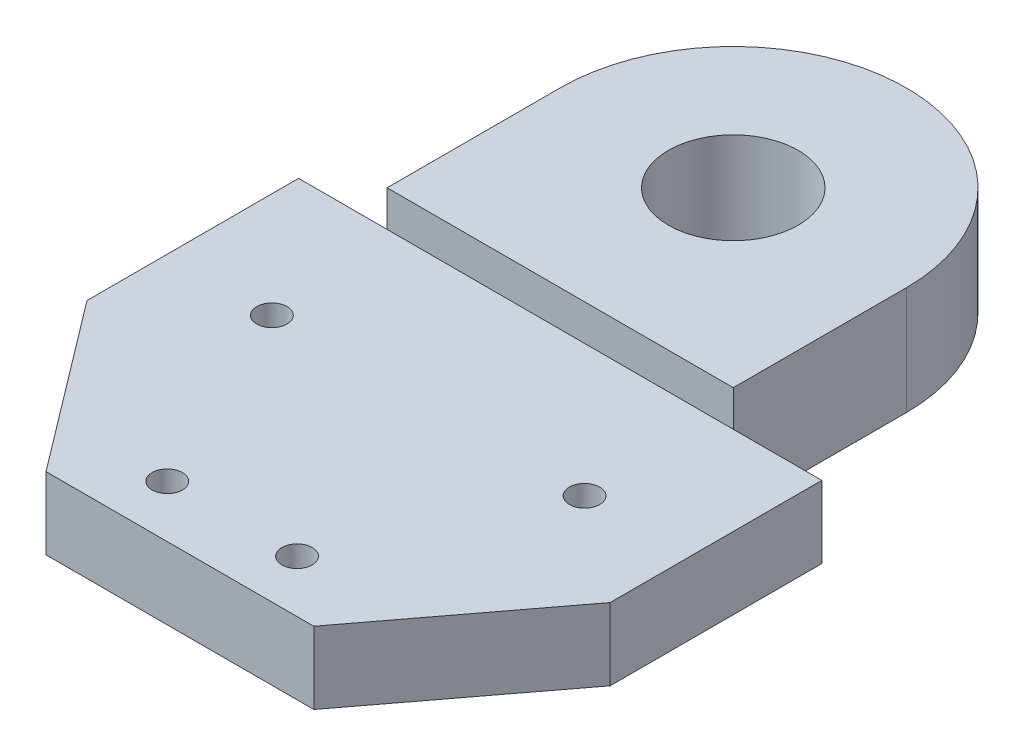
ISO-10303-21;
HEADER;
FILE_DESCRIPTION(('STEP AP214'),'2;1');
FILE_NAME('part.step','',(''),(''),'','','');
FILE_SCHEMA(('AUTOMOTIVE_DESIGN { 1 0 10303 214 1 1 1 1 }'));
ENDSEC;
DATA;
#1=APPLICATION_CONTEXT('core data for automotive mechanical design processes');
#2=APPLICATION_PROTOCOL_DEFINITION('international standard','automotive_design',2000,#1);
#3=PRODUCT_CONTEXT('',#1,'mechanical');
#4=PRODUCT('Part','Part','',(#3));
#5=PRODUCT_RELATED_PRODUCT_CATEGORY('part','',(#4));
#6=PRODUCT_DEFINITION_FORMATION('','',#4);
#7=PRODUCT_DEFINITION_CONTEXT('part definition',#1,'design');
#8=PRODUCT_DEFINITION('design','',#6,#7);
#9=PRODUCT_DEFINITION_SHAPE('','',#8);
#10=(LENGTH_UNIT() NAMED_UNIT(*) SI_UNIT(.MILLI.,.METRE.));
#11=(NAMED_UNIT(*) PLANE_ANGLE_UNIT() SI_UNIT($,.RADIAN.));
#12=(NAMED_UNIT(*) SI_UNIT($,.STERADIAN.) SOLID_ANGLE_UNIT());
#13=UNCERTAINTY_MEASURE_WITH_UNIT(LENGTH_MEASURE(1.E-05),#10,'distance_accuracy_value','');
#14=(GEOMETRIC_REPRESENTATION_CONTEXT(3) GLOBAL_UNCERTAINTY_ASSIGNED_CONTEXT((#13)) GLOBAL_UNIT_ASSIGNED_CONTEXT((#10,
#11,#12)) REPRESENTATION_CONTEXT('',''));
#15=CARTESIAN_POINT('',(0.,0.,0.));
#16=DIRECTION('',(0.,0.,1.));
#17=DIRECTION('',(1.,0.,0.));
#18=AXIS2_PLACEMENT_3D('',#15,#16,#17);
#19=CARTESIAN_POINT('',(-30.2250218467829,8.33333333333333,-37.9076946759163));
#20=DIRECTION('',(0.,0.,1.));
#21=DIRECTION('',(1.,0.,0.));
#22=AXIS2_PLACEMENT_3D('',#19,#20,#21);
#23=PLANE('',#22);
#24=DIRECTION('',(0.,-1.,0.));
#25=VECTOR('',#24,1.);
#26=CARTESIAN_POINT('',(20.,12.5,-37.9076946759163));
#27=LINE('',#26,#25);
#28=CARTESIAN_POINT('',(20.,8.33333333333333,-37.9076946759163));
#29=VERTEX_POINT('',#28);
#30=CARTESIAN_POINT('',(20.,0.,-37.9076946759163));
#31=VERTEX_POINT('',#30);
#32=EDGE_CURVE('E11',#29,#31,#27,.T.);
#33=ORIENTED_EDGE('',*,*,#32,.F.);
#34=DIRECTION('',(-1.,0.,0.));
#35=VECTOR('',#34,1.);
#36=CARTESIAN_POINT('',(30.225021846783,8.33333333333333,-37.9076946759163));
#37=LINE('',#36,#35);
#38=CARTESIAN_POINT('',(30.225021846783,8.33333333333333,-37.9076946759163));
#39=VERTEX_POINT('',#38);
#40=EDGE_CURVE('E147',#39,#29,#37,.T.);
#41=ORIENTED_EDGE('',*,*,#40,.F.);
#42=DIRECTION('',(0.,-1.,0.));
#43=VECTOR('',#42,1.);
#44=CARTESIAN_POINT('',(30.225021846783,8.33333333333333,-37.9076946759163));
#45=LINE('',#44,#43);
#46=CARTESIAN_POINT('',(30.225021846783,0.,-37.9076946759163));
#47=VERTEX_POINT('',#46);
#48=EDGE_CURVE('E137',#39,#47,#45,.T.);
#49=ORIENTED_EDGE('',*,*,#48,.T.);
#50=DIRECTION('',(-1.,0.,0.));
#51=VECTOR('',#50,1.);
#52=CARTESIAN_POINT('',(-30.2250218467829,0.,-37.9076946759163));
#53=LINE('',#52,#51);
#54=EDGE_CURVE('E168',#47,#31,#53,.T.);
#55=ORIENTED_EDGE('',*,*,#54,.T.);
#56=EDGE_LOOP('',(#33,#41,#49,#55));
#57=FACE_BOUND('',#56,.T.);
#58=ADVANCED_FACE('F39',(#57),#23,.F.);
#59=CARTESIAN_POINT('',(0.,8.33333333333333,0.));
#60=DIRECTION('',(0.,-1.,0.));
#61=DIRECTION('',(0.,0.,-1.));
#62=AXIS2_PLACEMENT_3D('',#59,#60,#61);
#63=PLANE('',#62);
#64=DIRECTION('',(0.,0.,1.));
#65=VECTOR('',#64,1.);
#66=CARTESIAN_POINT('',(-30.2250218467829,8.33333333333333,-13.4540284696905));
#67=LINE('',#66,#65);
#68=CARTESIAN_POINT('',(-30.2250218467829,8.33333333333333,-37.9076946759163));
#69=VERTEX_POINT('',#68);
#70=CARTESIAN_POINT('',(-30.2250218467829,8.33333333333333,-13.4540284696905));
#71=VERTEX_POINT('',#70);
#72=EDGE_CURVE('E172',#69,#71,#67,.T.);
#73=ORIENTED_EDGE('',*,*,#72,.T.);
#74=DIRECTION('',(0.603519095490218,0.,0.797348544476422));
#75=VECTOR('',#74,1.);
#76=CARTESIAN_POINT('',(-30.2250218467829,8.33333333333333,-13.4540284696905));
#77=LINE('',#76,#75);
#78=CARTESIAN_POINT('',(-15.4734854447642,8.33333333333333,6.03519095490218));
#79=VERTEX_POINT('',#78);
#80=EDGE_CURVE('E103',#71,#79,#77,.T.);
#81=ORIENTED_EDGE('',*,*,#80,.T.);
#82=DIRECTION('',(1.,0.,0.));
#83=VECTOR('',#82,1.);
#84=CARTESIAN_POINT('',(-15.4734854447642,8.33333333333333,6.03519095490218));
#85=LINE('',#84,#83);
#86=CARTESIAN_POINT('',(15.4734854447642,8.33333333333333,6.03519095490223));
#87=VERTEX_POINT('',#86);
#88=EDGE_CURVE('E121',#79,#87,#85,.T.);
#89=ORIENTED_EDGE('',*,*,#88,.T.);
#90=DIRECTION('',(0.603519095490223,0.,-0.797348544476418));
#91=VECTOR('',#90,1.);
#92=CARTESIAN_POINT('',(30.225021846783,8.33333333333333,-13.4540284696903));
#93=LINE('',#92,#91);
#94=CARTESIAN_POINT('',(30.225021846783,8.33333333333333,-13.4540284696903));
#95=VERTEX_POINT('',#94);
#96=EDGE_CURVE('E112',#87,#95,#93,.T.);
#97=ORIENTED_EDGE('',*,*,#96,.T.);
#98=DIRECTION('',(0.,0.,-1.));
#99=VECTOR('',#98,1.);
#100=CARTESIAN_POINT('',(30.225021846783,8.33333333333333,-13.4540284696903));
#101=LINE('',#100,#99);
#102=EDGE_CURVE('E118',#95,#39,#101,.T.);
#103=ORIENTED_EDGE('',*,*,#102,.T.);
#104=ORIENTED_EDGE('',*,*,#40,.T.);
#105=CARTESIAN_POINT('',(-20.,8.33333333333333,-37.9076946759163));
#106=VERTEX_POINT('',#105);
#107=EDGE_CURVE('E145',#29,#106,#37,.T.);
#108=ORIENTED_EDGE('',*,*,#107,.T.);
#109=EDGE_CURVE('E67',#106,#69,#37,.T.);
#110=ORIENTED_EDGE('',*,*,#109,.T.);
#111=EDGE_LOOP('',(#73,#81,#89,#97,#103,#104,#108,#110));
#112=FACE_BOUND('',#111,.T.);
#113=CARTESIAN_POINT('',(-18.0654565435174,8.33333333333333,-22.6576946759163));
#114=DIRECTION('',(0.,1.,0.));
#115=DIRECTION('',(0.,0.,1.));
#116=AXIS2_PLACEMENT_3D('',#113,#114,#115);
#117=CIRCLE('',#116,1.75);
#118=CARTESIAN_POINT('',(-18.0654565435174,8.33333333333333,-20.9076946759163));
#119=VERTEX_POINT('',#118);
#120=EDGE_CURVE('E157',#119,#119,#117,.T.);
#121=ORIENTED_EDGE('',*,*,#120,.F.);
#122=EDGE_LOOP('',(#121));
#123=FACE_BOUND('',#122,.T.);
#124=CARTESIAN_POINT('',(18.0654565435176,8.33333333333333,-22.6576946759162));
#125=DIRECTION('',(0.,1.,0.));
#126=DIRECTION('',(0.,0.,1.));
#127=AXIS2_PLACEMENT_3D('',#124,#125,#126);
#128=CIRCLE('',#127,1.75);
#129=CARTESIAN_POINT('',(18.0654565435176,8.33333333333333,-20.9076946759162));
#130=VERTEX_POINT('',#129);
#131=EDGE_CURVE('E321',#130,#130,#128,.T.);
#132=ORIENTED_EDGE('',*,*,#131,.F.);
#133=EDGE_LOOP('',(#132));
#134=FACE_BOUND('',#133,.T.);
#135=CARTESIAN_POINT('',(7.5,8.33333333333333,0.));
#136=DIRECTION('',(0.,1.,0.));
#137=DIRECTION('',(0.,0.,1.));
#138=AXIS2_PLACEMENT_3D('',#135,#136,#137);
#139=CIRCLE('',#138,1.75);
#140=CARTESIAN_POINT('',(7.5,8.33333333333333,1.75));
#141=VERTEX_POINT('',#140);
#142=EDGE_CURVE('E329',#141,#141,#139,.T.);
#143=ORIENTED_EDGE('',*,*,#142,.F.);
#144=EDGE_LOOP('',(#143));
#145=FACE_BOUND('',#144,.T.);
#146=CARTESIAN_POINT('',(-7.5,8.33333333333333,0.));
#147=DIRECTION('',(0.,1.,0.));
#148=DIRECTION('',(0.,0.,1.));
#149=AXIS2_PLACEMENT_3D('',#146,#147,#148);
#150=CIRCLE('',#149,1.75);
#151=CARTESIAN_POINT('',(-7.5,8.33333333333333,1.75));
#152=VERTEX_POINT('',#151);
#153=EDGE_CURVE('E337',#152,#152,#150,.T.);
#154=ORIENTED_EDGE('',*,*,#153,.F.);
#155=EDGE_LOOP('',(#154));
#156=FACE_BOUND('',#155,.T.);
#157=ADVANCED_FACE('F114',(#112,#123,#134,#145,#156),#63,.F.);
#158=CARTESIAN_POINT('',(0.,0.,0.));
#159=DIRECTION('',(0.,-1.,0.));
#160=DIRECTION('',(0.,0.,-1.));
#161=AXIS2_PLACEMENT_3D('',#158,#159,#160);
#162=PLANE('',#161);
#163=CARTESIAN_POINT('',(7.5,0.,0.));
#164=DIRECTION('',(0.,1.,0.));
#165=DIRECTION('',(0.,0.,1.));
#166=AXIS2_PLACEMENT_3D('',#163,#164,#165);
#167=CIRCLE('',#166,1.75);
#168=CARTESIAN_POINT('',(7.5,0.,1.75));
#169=VERTEX_POINT('',#168);
#170=EDGE_CURVE('E333',#169,#169,#167,.T.);
#171=ORIENTED_EDGE('',*,*,#170,.T.);
#172=EDGE_LOOP('',(#171));
#173=FACE_BOUND('',#172,.T.);
#174=CARTESIAN_POINT('',(-18.0654565435174,0.,-22.6576946759163));
#175=DIRECTION('',(0.,1.,0.));
#176=DIRECTION('',(0.,0.,1.));
#177=AXIS2_PLACEMENT_3D('',#174,#175,#176);
#178=CIRCLE('',#177,1.75);
#179=CARTESIAN_POINT('',(-18.0654565435174,0.,-20.9076946759163));
#180=VERTEX_POINT('',#179);
#181=EDGE_CURVE('E317',#180,#180,#178,.T.);
#182=ORIENTED_EDGE('',*,*,#181,.T.);
#183=EDGE_LOOP('',(#182));
#184=FACE_BOUND('',#183,.T.);
#185=DIRECTION('',(0.,0.,1.));
#186=VECTOR('',#185,1.);
#187=CARTESIAN_POINT('',(-30.2250218467829,0.,-13.4540284696905));
#188=LINE('',#187,#186);
#189=CARTESIAN_POINT('',(-30.2250218467829,0.,-37.9076946759163));
#190=VERTEX_POINT('',#189);
#191=CARTESIAN_POINT('',(-30.2250218467829,0.,-13.4540284696905));
#192=VERTEX_POINT('',#191);
#193=EDGE_CURVE('E152',#190,#192,#188,.T.);
#194=ORIENTED_EDGE('',*,*,#193,.F.);
#195=CARTESIAN_POINT('',(-20.,0.,-37.9076946759163));
#196=VERTEX_POINT('',#195);
#197=EDGE_CURVE('E94',#196,#190,#53,.T.);
#198=ORIENTED_EDGE('',*,*,#197,.F.);
#199=DIRECTION('',(0.,0.,1.));
#200=VECTOR('',#199,1.);
#201=CARTESIAN_POINT('',(-20.,0.,-57.9076946759163));
#202=LINE('',#201,#200);
#203=CARTESIAN_POINT('',(-20.,0.,-57.9076946759163));
#204=VERTEX_POINT('',#203);
#205=EDGE_CURVE('E58',#204,#196,#202,.T.);
#206=ORIENTED_EDGE('',*,*,#205,.F.);
#207=CARTESIAN_POINT('',(0.,0.,-57.9076946759163));
#208=DIRECTION('',(0.,1.,0.));
#209=DIRECTION('',(0.,0.,1.));
#210=AXIS2_PLACEMENT_3D('',#207,#208,#209);
#211=CIRCLE('',#210,20.);
#212=CARTESIAN_POINT('',(20.,0.,-57.9076946759163));
#213=VERTEX_POINT('',#212);
#214=EDGE_CURVE('E218',#213,#204,#211,.T.);
#215=ORIENTED_EDGE('',*,*,#214,.F.);
#216=DIRECTION('',(0.,0.,-1.));
#217=VECTOR('',#216,1.);
#218=CARTESIAN_POINT('',(20.,0.,-37.9076946759163));
#219=LINE('',#218,#217);
#220=EDGE_CURVE('E211',#31,#213,#219,.T.);
#221=ORIENTED_EDGE('',*,*,#220,.F.);
#222=ORIENTED_EDGE('',*,*,#54,.F.);
#223=DIRECTION('',(0.,0.,-1.));
#224=VECTOR('',#223,1.);
#225=CARTESIAN_POINT('',(30.225021846783,0.,-13.4540284696903));
#226=LINE('',#225,#224);
#227=CARTESIAN_POINT('',(30.225021846783,0.,-13.4540284696903));
#228=VERTEX_POINT('',#227);
#229=EDGE_CURVE('E165',#228,#47,#226,.T.);
#230=ORIENTED_EDGE('',*,*,#229,.F.);
#231=DIRECTION('',(0.603519095490223,0.,-0.797348544476418));
#232=VECTOR('',#231,1.);
#233=CARTESIAN_POINT('',(30.225021846783,0.,-13.4540284696903));
#234=LINE('',#233,#232);
#235=CARTESIAN_POINT('',(15.4734854447642,0.,6.03519095490223));
#236=VERTEX_POINT('',#235);
#237=EDGE_CURVE('E131',#236,#228,#234,.T.);
#238=ORIENTED_EDGE('',*,*,#237,.F.);
#239=DIRECTION('',(1.,0.,0.));
#240=VECTOR('',#239,1.);
#241=CARTESIAN_POINT('',(-15.4734854447642,0.,6.03519095490218));
#242=LINE('',#241,#240);
#243=CARTESIAN_POINT('',(-15.4734854447642,0.,6.03519095490218));
#244=VERTEX_POINT('',#243);
#245=EDGE_CURVE('E160',#244,#236,#242,.T.);
#246=ORIENTED_EDGE('',*,*,#245,.F.);
#247=DIRECTION('',(0.603519095490218,0.,0.797348544476422));
#248=VECTOR('',#247,1.);
#249=CARTESIAN_POINT('',(-30.2250218467829,0.,-13.4540284696905));
#250=LINE('',#249,#248);
#251=EDGE_CURVE('E156',#192,#244,#250,.T.);
#252=ORIENTED_EDGE('',*,*,#251,.F.);
#253=EDGE_LOOP('',(#194,#198,#206,#215,#221,#222,#230,#238,#246,#252));
#254=FACE_BOUND('',#253,.T.);
#255=CARTESIAN_POINT('',(18.0654565435176,0.,-22.6576946759162));
#256=DIRECTION('',(0.,1.,0.));
#257=DIRECTION('',(0.,0.,1.));
#258=AXIS2_PLACEMENT_3D('',#255,#256,#257);
#259=CIRCLE('',#258,1.75);
#260=CARTESIAN_POINT('',(18.0654565435176,0.,-20.9076946759162));
#261=VERTEX_POINT('',#260);
#262=EDGE_CURVE('E325',#261,#261,#259,.T.);
#263=ORIENTED_EDGE('',*,*,#262,.T.);
#264=EDGE_LOOP('',(#263));
#265=FACE_BOUND('',#264,.T.);
#266=CARTESIAN_POINT('',(-7.5,0.,0.));
#267=DIRECTION('',(0.,1.,0.));
#268=DIRECTION('',(0.,0.,1.));
#269=AXIS2_PLACEMENT_3D('',#266,#267,#268);
#270=CIRCLE('',#269,1.75);
#271=CARTESIAN_POINT('',(-7.5,0.,1.75));
#272=VERTEX_POINT('',#271);
#273=EDGE_CURVE('E198',#272,#272,#270,.T.);
#274=ORIENTED_EDGE('',*,*,#273,.T.);
#275=EDGE_LOOP('',(#274));
#276=FACE_BOUND('',#275,.T.);
#277=CARTESIAN_POINT('',(0.,0.,-57.9076946759163));
#278=DIRECTION('',(0.,1.,0.));
#279=DIRECTION('',(0.,0.,1.));
#280=AXIS2_PLACEMENT_3D('',#277,#278,#279);
#281=CIRCLE('',#280,7.5);
#282=CARTESIAN_POINT('',(0.,0.,-50.4076946759163));
#283=VERTEX_POINT('',#282);
#284=EDGE_CURVE('E237',#283,#283,#281,.T.);
#285=ORIENTED_EDGE('',*,*,#284,.T.);
#286=EDGE_LOOP('',(#285));
#287=FACE_BOUND('',#286,.T.);
#288=ADVANCED_FACE('F273',(#173,#184,#254,#265,#276,#287),#162,.T.);
#289=CARTESIAN_POINT('',(-30.2250218467829,8.33333333333333,-13.4540284696905));
#290=DIRECTION('',(1.,0.,0.));
#291=DIRECTION('',(0.,0.,-1.));
#292=AXIS2_PLACEMENT_3D('',#289,#290,#291);
#293=PLANE('',#292);
#294=ORIENTED_EDGE('',*,*,#193,.T.);
#295=DIRECTION('',(0.,-1.,0.));
#296=VECTOR('',#295,1.);
#297=CARTESIAN_POINT('',(-30.2250218467829,8.33333333333333,-13.4540284696905));
#298=LINE('',#297,#296);
#299=EDGE_CURVE('E43',#71,#192,#298,.T.);
#300=ORIENTED_EDGE('',*,*,#299,.F.);
#301=ORIENTED_EDGE('',*,*,#72,.F.);
#302=DIRECTION('',(0.,-1.,0.));
#303=VECTOR('',#302,1.);
#304=CARTESIAN_POINT('',(-30.2250218467829,8.33333333333333,-37.9076946759163));
#305=LINE('',#304,#303);
#306=EDGE_CURVE('E151',#69,#190,#305,.T.);
#307=ORIENTED_EDGE('',*,*,#306,.T.);
#308=EDGE_LOOP('',(#294,#300,#301,#307));
#309=FACE_BOUND('',#308,.T.);
#310=ADVANCED_FACE('F41',(#309),#293,.F.);
#311=CARTESIAN_POINT('',(-30.2250218467829,8.33333333333333,-13.4540284696905));
#312=DIRECTION('',(0.797348544476422,0.,-0.603519095490218));
#313=DIRECTION('',(-0.603519095490218,0.,-0.797348544476423));
#314=AXIS2_PLACEMENT_3D('',#311,#312,#313);
#315=PLANE('',#314);
#316=ORIENTED_EDGE('',*,*,#251,.T.);
#317=DIRECTION('',(0.,-1.,0.));
#318=VECTOR('',#317,1.);
#319=CARTESIAN_POINT('',(-15.4734854447642,8.33333333333333,6.03519095490218));
#320=LINE('',#319,#318);
#321=EDGE_CURVE('E178',#79,#244,#320,.T.);
#322=ORIENTED_EDGE('',*,*,#321,.F.);
#323=ORIENTED_EDGE('',*,*,#80,.F.);
#324=ORIENTED_EDGE('',*,*,#299,.T.);
#325=EDGE_LOOP('',(#316,#322,#323,#324));
#326=FACE_BOUND('',#325,.T.);
#327=ADVANCED_FACE('F350',(#326),#315,.F.);
#328=CARTESIAN_POINT('',(-15.4734854447642,8.33333333333333,6.03519095490218));
#329=DIRECTION('',(0.,0.,-1.));
#330=DIRECTION('',(-1.,0.,0.));
#331=AXIS2_PLACEMENT_3D('',#328,#329,#330);
#332=PLANE('',#331);
#333=ORIENTED_EDGE('',*,*,#245,.T.);
#334=DIRECTION('',(0.,-1.,0.));
#335=VECTOR('',#334,1.);
#336=CARTESIAN_POINT('',(15.4734854447642,8.33333333333333,6.03519095490223));
#337=LINE('',#336,#335);
#338=EDGE_CURVE('E136',#87,#236,#337,.T.);
#339=ORIENTED_EDGE('',*,*,#338,.F.);
#340=ORIENTED_EDGE('',*,*,#88,.F.);
#341=ORIENTED_EDGE('',*,*,#321,.T.);
#342=EDGE_LOOP('',(#333,#339,#340,#341));
#343=FACE_BOUND('',#342,.T.);
#344=ADVANCED_FACE('F351',(#343),#332,.F.);
#345=CARTESIAN_POINT('',(30.225021846783,8.33333333333333,-13.4540284696903));
#346=DIRECTION('',(-0.797348544476418,0.,-0.603519095490223));
#347=DIRECTION('',(-0.603519095490223,0.,0.797348544476418));
#348=AXIS2_PLACEMENT_3D('',#345,#346,#347);
#349=PLANE('',#348);
#350=ORIENTED_EDGE('',*,*,#237,.T.);
#351=DIRECTION('',(0.,-1.,0.));
#352=VECTOR('',#351,1.);
#353=CARTESIAN_POINT('',(30.225021846783,8.33333333333333,-13.4540284696903));
#354=LINE('',#353,#352);
#355=EDGE_CURVE('E128',#95,#228,#354,.T.);
#356=ORIENTED_EDGE('',*,*,#355,.F.);
#357=ORIENTED_EDGE('',*,*,#96,.F.);
#358=ORIENTED_EDGE('',*,*,#338,.T.);
#359=EDGE_LOOP('',(#350,#356,#357,#358));
#360=FACE_BOUND('',#359,.T.);
#361=ADVANCED_FACE('F129',(#360),#349,.F.);
#362=CARTESIAN_POINT('',(30.225021846783,8.33333333333333,-13.4540284696903));
#363=DIRECTION('',(-1.,0.,0.));
#364=DIRECTION('',(0.,0.,1.));
#365=AXIS2_PLACEMENT_3D('',#362,#363,#364);
#366=PLANE('',#365);
#367=ORIENTED_EDGE('',*,*,#229,.T.);
#368=ORIENTED_EDGE('',*,*,#48,.F.);
#369=ORIENTED_EDGE('',*,*,#102,.F.);
#370=ORIENTED_EDGE('',*,*,#355,.T.);
#371=EDGE_LOOP('',(#367,#368,#369,#370));
#372=FACE_BOUND('',#371,.T.);
#373=ADVANCED_FACE('F139',(#372),#366,.F.);
#374=ORIENTED_EDGE('',*,*,#109,.F.);
#375=DIRECTION('',(0.,-1.,0.));
#376=VECTOR('',#375,1.);
#377=CARTESIAN_POINT('',(-20.,12.5,-37.9076946759163));
#378=LINE('',#377,#376);
#379=EDGE_CURVE('E49',#106,#196,#378,.T.);
#380=ORIENTED_EDGE('',*,*,#379,.T.);
#381=ORIENTED_EDGE('',*,*,#197,.T.);
#382=ORIENTED_EDGE('',*,*,#306,.F.);
#383=EDGE_LOOP('',(#374,#380,#381,#382));
#384=FACE_BOUND('',#383,.T.);
#385=ADVANCED_FACE('F269',(#384),#23,.F.);
#386=CARTESIAN_POINT('',(-18.0654565435174,8.33333333333333,-22.6576946759163));
#387=DIRECTION('',(0.,-1.,0.));
#388=DIRECTION('',(0.,0.,-1.));
#389=AXIS2_PLACEMENT_3D('',#386,#387,#388);
#390=CYLINDRICAL_SURFACE('',#389,1.75);
#391=ORIENTED_EDGE('',*,*,#120,.T.);
#392=EDGE_LOOP('',(#391));
#393=FACE_BOUND('',#392,.T.);
#394=ORIENTED_EDGE('',*,*,#181,.F.);
#395=EDGE_LOOP('',(#394));
#396=FACE_BOUND('',#395,.T.);
#397=ADVANCED_FACE('F278',(#393,#396),#390,.F.);
#398=CARTESIAN_POINT('',(18.0654565435176,8.33333333333333,-22.6576946759162));
#399=DIRECTION('',(0.,-1.,0.));
#400=DIRECTION('',(0.,0.,-1.));
#401=AXIS2_PLACEMENT_3D('',#398,#399,#400);
#402=CYLINDRICAL_SURFACE('',#401,1.75);
#403=ORIENTED_EDGE('',*,*,#131,.T.);
#404=EDGE_LOOP('',(#403));
#405=FACE_BOUND('',#404,.T.);
#406=ORIENTED_EDGE('',*,*,#262,.F.);
#407=EDGE_LOOP('',(#406));
#408=FACE_BOUND('',#407,.T.);
#409=ADVANCED_FACE('F283',(#405,#408),#402,.F.);
#410=CARTESIAN_POINT('',(7.5,8.33333333333333,0.));
#411=DIRECTION('',(0.,-1.,0.));
#412=DIRECTION('',(0.,0.,-1.));
#413=AXIS2_PLACEMENT_3D('',#410,#411,#412);
#414=CYLINDRICAL_SURFACE('',#413,1.75);
#415=ORIENTED_EDGE('',*,*,#142,.T.);
#416=EDGE_LOOP('',(#415));
#417=FACE_BOUND('',#416,.T.);
#418=ORIENTED_EDGE('',*,*,#170,.F.);
#419=EDGE_LOOP('',(#418));
#420=FACE_BOUND('',#419,.T.);
#421=ADVANCED_FACE('F261',(#417,#420),#414,.F.);
#422=CARTESIAN_POINT('',(-7.5,8.33333333333333,0.));
#423=DIRECTION('',(0.,-1.,0.));
#424=DIRECTION('',(0.,0.,-1.));
#425=AXIS2_PLACEMENT_3D('',#422,#423,#424);
#426=CYLINDRICAL_SURFACE('',#425,1.75);
#427=ORIENTED_EDGE('',*,*,#153,.T.);
#428=EDGE_LOOP('',(#427));
#429=FACE_BOUND('',#428,.T.);
#430=ORIENTED_EDGE('',*,*,#273,.F.);
#431=EDGE_LOOP('',(#430));
#432=FACE_BOUND('',#431,.T.);
#433=ADVANCED_FACE('F251',(#429,#432),#426,.F.);
#434=CARTESIAN_POINT('',(0.,12.5,-57.9076946759163));
#435=DIRECTION('',(0.,1.,0.));
#436=DIRECTION('',(0.,0.,1.));
#437=AXIS2_PLACEMENT_3D('',#434,#435,#436);
#438=PLANE('',#437);
#439=CARTESIAN_POINT('',(0.,12.5,-57.9076946759163));
#440=DIRECTION('',(0.,1.,0.));
#441=DIRECTION('',(0.,0.,1.));
#442=AXIS2_PLACEMENT_3D('',#439,#440,#441);
#443=CIRCLE('',#442,20.);
#444=CARTESIAN_POINT('',(20.,12.5,-57.9076946759163));
#445=VERTEX_POINT('',#444);
#446=CARTESIAN_POINT('',(-20.,12.5,-57.9076946759163));
#447=VERTEX_POINT('',#446);
#448=EDGE_CURVE('E215',#445,#447,#443,.T.);
#449=ORIENTED_EDGE('',*,*,#448,.T.);
#450=DIRECTION('',(0.,0.,1.));
#451=VECTOR('',#450,1.);
#452=CARTESIAN_POINT('',(-20.,12.5,-57.9076946759163));
#453=LINE('',#452,#451);
#454=CARTESIAN_POINT('',(-20.,12.5,-37.9076946759163));
#455=VERTEX_POINT('',#454);
#456=EDGE_CURVE('E230',#447,#455,#453,.T.);
#457=ORIENTED_EDGE('',*,*,#456,.T.);
#458=DIRECTION('',(1.,0.,0.));
#459=VECTOR('',#458,1.);
#460=CARTESIAN_POINT('',(-20.,12.5,-37.9076946759163));
#461=LINE('',#460,#459);
#462=CARTESIAN_POINT('',(20.,12.5,-37.9076946759163));
#463=VERTEX_POINT('',#462);
#464=EDGE_CURVE('E226',#455,#463,#461,.T.);
#465=ORIENTED_EDGE('',*,*,#464,.T.);
#466=DIRECTION('',(0.,0.,-1.));
#467=VECTOR('',#466,1.);
#468=CARTESIAN_POINT('',(20.,12.5,-37.9076946759163));
#469=LINE('',#468,#467);
#470=EDGE_CURVE('E208',#463,#445,#469,.T.);
#471=ORIENTED_EDGE('',*,*,#470,.T.);
#472=EDGE_LOOP('',(#449,#457,#465,#471));
#473=FACE_BOUND('',#472,.T.);
#474=CARTESIAN_POINT('',(0.,12.5,-57.9076946759163));
#475=DIRECTION('',(0.,1.,0.));
#476=DIRECTION('',(0.,0.,1.));
#477=AXIS2_PLACEMENT_3D('',#474,#475,#476);
#478=CIRCLE('',#477,7.5);
#479=CARTESIAN_POINT('',(0.,12.5,-50.4076946759163));
#480=VERTEX_POINT('',#479);
#481=EDGE_CURVE('E222',#480,#480,#478,.T.);
#482=ORIENTED_EDGE('',*,*,#481,.F.);
#483=EDGE_LOOP('',(#482));
#484=FACE_BOUND('',#483,.T.);
#485=ADVANCED_FACE('F248',(#473,#484),#438,.T.);
#486=CARTESIAN_POINT('',(0.,12.5,-57.9076946759163));
#487=DIRECTION('',(0.,-1.,0.));
#488=DIRECTION('',(0.,0.,-1.));
#489=AXIS2_PLACEMENT_3D('',#486,#487,#488);
#490=CYLINDRICAL_SURFACE('',#489,20.);
#491=ORIENTED_EDGE('',*,*,#214,.T.);
#492=DIRECTION('',(0.,-1.,0.));
#493=VECTOR('',#492,1.);
#494=CARTESIAN_POINT('',(-20.,12.5,-57.9076946759163));
#495=LINE('',#494,#493);
#496=EDGE_CURVE('E191',#447,#204,#495,.T.);
#497=ORIENTED_EDGE('',*,*,#496,.F.);
#498=ORIENTED_EDGE('',*,*,#448,.F.);
#499=DIRECTION('',(0.,-1.,0.));
#500=VECTOR('',#499,1.);
#501=CARTESIAN_POINT('',(20.,12.5,-57.9076946759163));
#502=LINE('',#501,#500);
#503=EDGE_CURVE('E200',#445,#213,#502,.T.);
#504=ORIENTED_EDGE('',*,*,#503,.T.);
#505=EDGE_LOOP('',(#491,#497,#498,#504));
#506=FACE_BOUND('',#505,.T.);
#507=ADVANCED_FACE('F250',(#506),#490,.T.);
#508=CARTESIAN_POINT('',(-20.,12.5,-57.9076946759163));
#509=DIRECTION('',(1.,0.,0.));
#510=DIRECTION('',(0.,0.,-1.));
#511=AXIS2_PLACEMENT_3D('',#508,#509,#510);
#512=PLANE('',#511);
#513=ORIENTED_EDGE('',*,*,#205,.T.);
#514=ORIENTED_EDGE('',*,*,#379,.F.);
#515=EDGE_CURVE('E187',#455,#106,#378,.T.);
#516=ORIENTED_EDGE('',*,*,#515,.F.);
#517=ORIENTED_EDGE('',*,*,#456,.F.);
#518=ORIENTED_EDGE('',*,*,#496,.T.);
#519=EDGE_LOOP('',(#513,#514,#516,#517,#518));
#520=FACE_BOUND('',#519,.T.);
#521=ADVANCED_FACE('F258',(#520),#512,.F.);
#522=CARTESIAN_POINT('',(-20.,12.5,-37.9076946759163));
#523=DIRECTION('',(0.,0.,-1.));
#524=DIRECTION('',(-1.,0.,0.));
#525=AXIS2_PLACEMENT_3D('',#522,#523,#524);
#526=PLANE('',#525);
#527=ORIENTED_EDGE('',*,*,#107,.F.);
#528=EDGE_CURVE('E51',#463,#29,#27,.T.);
#529=ORIENTED_EDGE('',*,*,#528,.F.);
#530=ORIENTED_EDGE('',*,*,#464,.F.);
#531=ORIENTED_EDGE('',*,*,#515,.T.);
#532=EDGE_LOOP('',(#527,#529,#530,#531));
#533=FACE_BOUND('',#532,.T.);
#534=ADVANCED_FACE('F288',(#533),#526,.F.);
#535=CARTESIAN_POINT('',(20.,12.5,-37.9076946759163));
#536=DIRECTION('',(-1.,0.,0.));
#537=DIRECTION('',(0.,0.,1.));
#538=AXIS2_PLACEMENT_3D('',#535,#536,#537);
#539=PLANE('',#538);
#540=ORIENTED_EDGE('',*,*,#220,.T.);
#541=ORIENTED_EDGE('',*,*,#503,.F.);
#542=ORIENTED_EDGE('',*,*,#470,.F.);
#543=ORIENTED_EDGE('',*,*,#528,.T.);
#544=ORIENTED_EDGE('',*,*,#32,.T.);
#545=EDGE_LOOP('',(#540,#541,#542,#543,#544));
#546=FACE_BOUND('',#545,.T.);
#547=ADVANCED_FACE('F352',(#546),#539,.F.);
#548=CARTESIAN_POINT('',(0.,12.5,-57.9076946759163));
#549=DIRECTION('',(0.,-1.,0.));
#550=DIRECTION('',(0.,0.,-1.));
#551=AXIS2_PLACEMENT_3D('',#548,#549,#550);
#552=CYLINDRICAL_SURFACE('',#551,7.5);
#553=ORIENTED_EDGE('',*,*,#481,.T.);
#554=EDGE_LOOP('',(#553));
#555=FACE_BOUND('',#554,.T.);
#556=ORIENTED_EDGE('',*,*,#284,.F.);
#557=EDGE_LOOP('',(#556));
#558=FACE_BOUND('',#557,.T.);
#559=ADVANCED_FACE('F245',(#555,#558),#552,.F.);
#560=CLOSED_SHELL('',(#58,#157,#288,#310,#327,#344,#361,#373,#385,#397,#409,#421,#433,#485,#507,
#521,#534,#547,#559));
#561=MANIFOLD_SOLID_BREP('B2',#560);
#562=ADVANCED_BREP_SHAPE_REPRESENTATION('',(#18,#561),#14);
#563=SHAPE_DEFINITION_REPRESENTATION(#9,#562);
ENDSEC;
END-ISO-10303-21;
